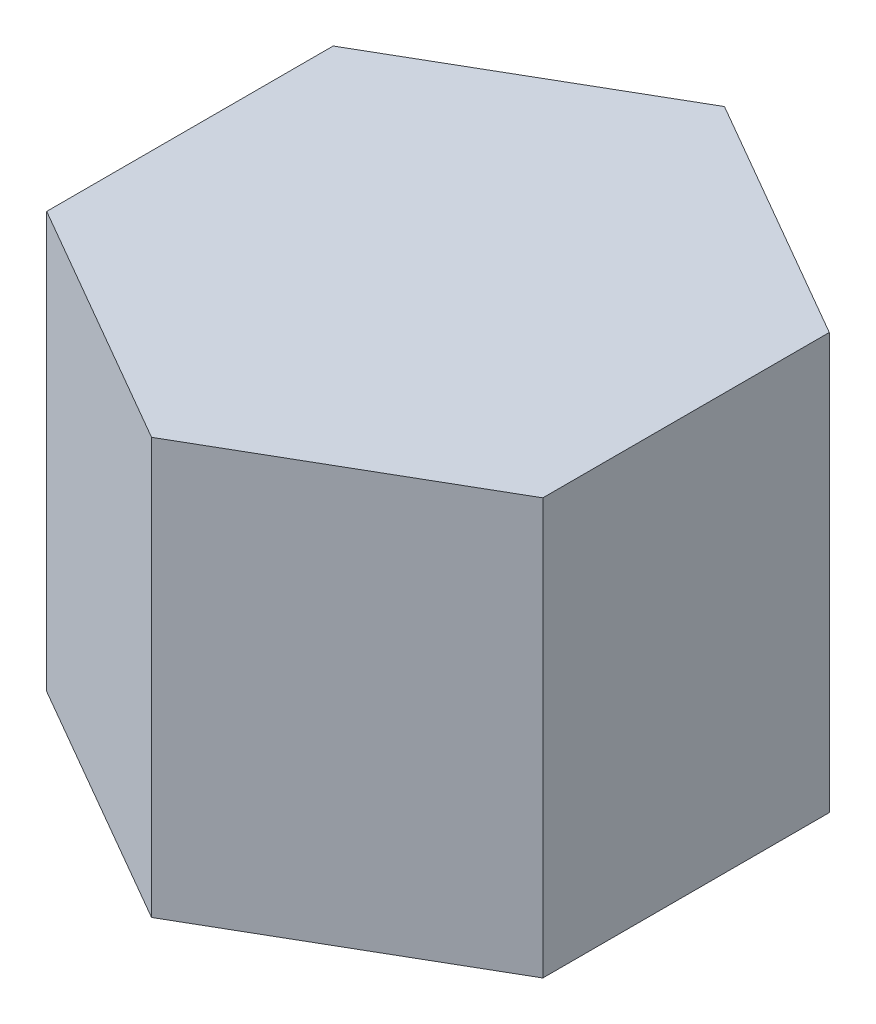
ISO-10303-21;
HEADER;
FILE_DESCRIPTION(('STEP AP214'),'2;1');
FILE_NAME('part.step','',(''),(''),'','','');
FILE_SCHEMA(('AUTOMOTIVE_DESIGN { 1 0 10303 214 1 1 1 1 }'));
ENDSEC;
DATA;
#1=APPLICATION_CONTEXT('core data for automotive mechanical design processes');
#2=APPLICATION_PROTOCOL_DEFINITION('international standard','automotive_design',2000,#1);
#3=PRODUCT_CONTEXT('',#1,'mechanical');
#4=PRODUCT('Part','Part','',(#3));
#5=PRODUCT_RELATED_PRODUCT_CATEGORY('part','',(#4));
#6=PRODUCT_DEFINITION_FORMATION('','',#4);
#7=PRODUCT_DEFINITION_CONTEXT('part definition',#1,'design');
#8=PRODUCT_DEFINITION('design','',#6,#7);
#9=PRODUCT_DEFINITION_SHAPE('','',#8);
#10=(LENGTH_UNIT() NAMED_UNIT(*) SI_UNIT(.MILLI.,.METRE.));
#11=(NAMED_UNIT(*) PLANE_ANGLE_UNIT() SI_UNIT($,.RADIAN.));
#12=(NAMED_UNIT(*) SI_UNIT($,.STERADIAN.) SOLID_ANGLE_UNIT());
#13=UNCERTAINTY_MEASURE_WITH_UNIT(LENGTH_MEASURE(1.E-05),#10,'distance_accuracy_value','');
#14=(GEOMETRIC_REPRESENTATION_CONTEXT(3) GLOBAL_UNCERTAINTY_ASSIGNED_CONTEXT((#13)) GLOBAL_UNIT_ASSIGNED_CONTEXT((#10,
#11,#12)) REPRESENTATION_CONTEXT('',''));
#15=CARTESIAN_POINT('',(0.,0.,0.));
#16=DIRECTION('',(0.,0.,1.));
#17=DIRECTION('',(1.,0.,0.));
#18=AXIS2_PLACEMENT_3D('',#15,#16,#17);
#19=CARTESIAN_POINT('',(210.642660308706,-148.537700895744,294.971072835632));
#20=DIRECTION('',(-0.499999999999909,0.,-0.866025403784491));
#21=DIRECTION('',(-0.866025403784491,0.,0.499999999999909));
#22=AXIS2_PLACEMENT_3D('',#19,#20,#21);
#23=PLANE('',#22);
#24=CARTESIAN_POINT('',(210.339551417381,-149.045793579175,295.146072835632));
#25=DIRECTION('',(0.866025403784491,0.,-0.499999999999909));
#26=VECTOR('',#25,1.);
#27=LINE('',#24,#26);
#28=CARTESIAN_POINT('',(210.339551417382,-149.045793579175,295.146072835632));
#29=VERTEX_POINT('',#28);
#30=CARTESIAN_POINT('',(210.642660308706,-149.045793579175,294.971072835632));
#31=VERTEX_POINT('',#30);
#32=EDGE_CURVE('E170',#29,#31,#27,.T.);
#33=ORIENTED_EDGE('',*,*,#32,.T.);
#34=CARTESIAN_POINT('',(210.642660308706,-148.537700895744,294.971072835632));
#35=DIRECTION('',(0.,-1.,0.));
#36=VECTOR('',#35,1.);
#37=LINE('',#34,#36);
#38=CARTESIAN_POINT('',(210.642660308706,-148.537700895744,294.971072835632));
#39=VERTEX_POINT('',#38);
#40=EDGE_CURVE('E35',#39,#31,#37,.T.);
#41=ORIENTED_EDGE('',*,*,#40,.F.);
#42=CARTESIAN_POINT('',(210.339551417381,-148.537700895744,295.146072835632));
#43=DIRECTION('',(0.866025403784491,0.,-0.499999999999909));
#44=VECTOR('',#43,1.);
#45=LINE('',#42,#44);
#46=CARTESIAN_POINT('',(210.339551417382,-148.537700895744,295.146072835632));
#47=VERTEX_POINT('',#46);
#48=EDGE_CURVE('E159',#47,#39,#45,.T.);
#49=ORIENTED_EDGE('',*,*,#48,.F.);
#50=CARTESIAN_POINT('',(210.339551417381,-148.537700895744,295.146072835632));
#51=DIRECTION('',(0.,-1.,0.));
#52=VECTOR('',#51,1.);
#53=LINE('',#50,#52);
#54=EDGE_CURVE('E10',#47,#29,#53,.T.);
#55=ORIENTED_EDGE('',*,*,#54,.T.);
#56=EDGE_LOOP('',(#33,#41,#49,#55));
#57=FACE_BOUND('',#56,.T.);
#58=ADVANCED_FACE('F16',(#57),#23,.F.);
#59=CARTESIAN_POINT('',(210.339551417382,-148.537700895744,295.146072835632));
#60=DIRECTION('',(0.500000000000096,0.,-0.866025403784383));
#61=DIRECTION('',(-0.866025403784383,0.,-0.500000000000096));
#62=AXIS2_PLACEMENT_3D('',#59,#60,#61);
#63=PLANE('',#62);
#64=CARTESIAN_POINT('',(210.036442526057,-149.045793579175,294.971072835632));
#65=DIRECTION('',(0.866025403784383,0.,0.500000000000096));
#66=VECTOR('',#65,1.);
#67=LINE('',#64,#66);
#68=CARTESIAN_POINT('',(210.036442526057,-149.045793579175,294.971072835632));
#69=VERTEX_POINT('',#68);
#70=EDGE_CURVE('E167',#69,#29,#67,.T.);
#71=ORIENTED_EDGE('',*,*,#70,.T.);
#72=ORIENTED_EDGE('',*,*,#54,.F.);
#73=CARTESIAN_POINT('',(210.036442526057,-148.537700895744,294.971072835632));
#74=DIRECTION('',(0.866025403784383,0.,0.500000000000096));
#75=VECTOR('',#74,1.);
#76=LINE('',#73,#75);
#77=CARTESIAN_POINT('',(210.036442526057,-148.537700895744,294.971072835632));
#78=VERTEX_POINT('',#77);
#79=EDGE_CURVE('E156',#78,#47,#76,.T.);
#80=ORIENTED_EDGE('',*,*,#79,.F.);
#81=CARTESIAN_POINT('',(210.036442526057,-148.537700895744,294.971072835632));
#82=DIRECTION('',(0.,-1.,0.));
#83=VECTOR('',#82,1.);
#84=LINE('',#81,#83);
#85=EDGE_CURVE('E27',#78,#69,#84,.T.);
#86=ORIENTED_EDGE('',*,*,#85,.T.);
#87=EDGE_LOOP('',(#71,#72,#80,#86));
#88=FACE_BOUND('',#87,.T.);
#89=ADVANCED_FACE('F189',(#88),#63,.F.);
#90=CARTESIAN_POINT('',(210.036442526057,-148.537700895744,290.831971220494));
#91=DIRECTION('',(1.,0.,0.));
#92=DIRECTION('',(0.,1.,0.));
#93=AXIS2_PLACEMENT_3D('',#90,#91,#92);
#94=PLANE('',#93);
#95=CARTESIAN_POINT('',(210.036442526057,-149.045793579175,294.621072835632));
#96=DIRECTION('',(0.,0.,1.));
#97=VECTOR('',#96,1.);
#98=LINE('',#95,#97);
#99=CARTESIAN_POINT('',(210.036442526057,-149.045793579175,294.621072835632));
#100=VERTEX_POINT('',#99);
#101=EDGE_CURVE('E163',#100,#69,#98,.T.);
#102=ORIENTED_EDGE('',*,*,#101,.T.);
#103=ORIENTED_EDGE('',*,*,#85,.F.);
#104=CARTESIAN_POINT('',(210.036442526057,-148.537700895744,294.621072835632));
#105=DIRECTION('',(0.,0.,1.));
#106=VECTOR('',#105,1.);
#107=LINE('',#104,#106);
#108=CARTESIAN_POINT('',(210.036442526057,-148.537700895744,294.621072835632));
#109=VERTEX_POINT('',#108);
#110=EDGE_CURVE('E106',#109,#78,#107,.T.);
#111=ORIENTED_EDGE('',*,*,#110,.F.);
#112=CARTESIAN_POINT('',(210.036442526057,-148.537700895744,294.621072835632));
#113=DIRECTION('',(0.,-1.,0.));
#114=VECTOR('',#113,1.);
#115=LINE('',#112,#114);
#116=EDGE_CURVE('E94',#109,#100,#115,.T.);
#117=ORIENTED_EDGE('',*,*,#116,.T.);
#118=EDGE_LOOP('',(#102,#103,#111,#117));
#119=FACE_BOUND('',#118,.T.);
#120=ADVANCED_FACE('F198',(#119),#94,.F.);
#121=CARTESIAN_POINT('',(210.036442526057,-148.537700895744,294.621072835632));
#122=DIRECTION('',(0.499999999999978,0.,0.866025403784452));
#123=DIRECTION('',(0.866025403784452,0.,-0.499999999999978));
#124=AXIS2_PLACEMENT_3D('',#121,#122,#123);
#125=PLANE('',#124);
#126=CARTESIAN_POINT('',(210.339551417382,-149.045793579175,294.446072835632));
#127=DIRECTION('',(-0.866025403784452,0.,0.499999999999978));
#128=VECTOR('',#127,1.);
#129=LINE('',#126,#128);
#130=CARTESIAN_POINT('',(210.339551417382,-149.045793579175,294.446072835632));
#131=VERTEX_POINT('',#130);
#132=EDGE_CURVE('E162',#131,#100,#129,.T.);
#133=ORIENTED_EDGE('',*,*,#132,.T.);
#134=ORIENTED_EDGE('',*,*,#116,.F.);
#135=CARTESIAN_POINT('',(210.339551417382,-148.537700895744,294.446072835632));
#136=DIRECTION('',(-0.866025403784452,0.,0.499999999999978));
#137=VECTOR('',#136,1.);
#138=LINE('',#135,#137);
#139=CARTESIAN_POINT('',(210.339551417382,-148.537700895744,294.446072835632));
#140=VERTEX_POINT('',#139);
#141=EDGE_CURVE('E98',#140,#109,#138,.T.);
#142=ORIENTED_EDGE('',*,*,#141,.F.);
#143=CARTESIAN_POINT('',(210.339551417382,-148.537700895744,294.446072835632));
#144=DIRECTION('',(0.,-1.,0.));
#145=VECTOR('',#144,1.);
#146=LINE('',#143,#145);
#147=EDGE_CURVE('E79',#140,#131,#146,.T.);
#148=ORIENTED_EDGE('',*,*,#147,.T.);
#149=EDGE_LOOP('',(#133,#134,#142,#148));
#150=FACE_BOUND('',#149,.T.);
#151=ADVANCED_FACE('F100',(#150),#125,.F.);
#152=CARTESIAN_POINT('',(210.339551417382,-148.537700895744,294.446072835632));
#153=DIRECTION('',(-0.500000000000062,0.,0.866025403784403));
#154=DIRECTION('',(0.866025403784403,0.,0.500000000000062));
#155=AXIS2_PLACEMENT_3D('',#152,#153,#154);
#156=PLANE('',#155);
#157=CARTESIAN_POINT('',(210.642660308706,-149.045793579175,294.621072835632));
#158=DIRECTION('',(-0.866025403784403,0.,-0.500000000000062));
#159=VECTOR('',#158,1.);
#160=LINE('',#157,#159);
#161=CARTESIAN_POINT('',(210.642660308706,-149.045793579175,294.621072835632));
#162=VERTEX_POINT('',#161);
#163=EDGE_CURVE('E88',#162,#131,#160,.T.);
#164=ORIENTED_EDGE('',*,*,#163,.T.);
#165=ORIENTED_EDGE('',*,*,#147,.F.);
#166=CARTESIAN_POINT('',(210.642660308706,-148.537700895744,294.621072835632));
#167=DIRECTION('',(-0.866025403784403,0.,-0.500000000000062));
#168=VECTOR('',#167,1.);
#169=LINE('',#166,#168);
#170=CARTESIAN_POINT('',(210.642660308706,-148.537700895744,294.621072835632));
#171=VERTEX_POINT('',#170);
#172=EDGE_CURVE('E84',#171,#140,#169,.T.);
#173=ORIENTED_EDGE('',*,*,#172,.F.);
#174=CARTESIAN_POINT('',(210.642660308706,-148.537700895744,294.621072835632));
#175=DIRECTION('',(0.,-1.,0.));
#176=VECTOR('',#175,1.);
#177=LINE('',#174,#176);
#178=EDGE_CURVE('E58',#171,#162,#177,.T.);
#179=ORIENTED_EDGE('',*,*,#178,.T.);
#180=EDGE_LOOP('',(#164,#165,#173,#179));
#181=FACE_BOUND('',#180,.T.);
#182=ADVANCED_FACE('F82',(#181),#156,.F.);
#183=CARTESIAN_POINT('',(210.642660308706,-148.537700895744,290.831971220494));
#184=DIRECTION('',(-1.,0.,0.));
#185=DIRECTION('',(0.,-1.,0.));
#186=AXIS2_PLACEMENT_3D('',#183,#184,#185);
#187=PLANE('',#186);
#188=CARTESIAN_POINT('',(210.642660308706,-149.045793579175,294.971072835632));
#189=DIRECTION('',(0.,0.,-1.));
#190=VECTOR('',#189,1.);
#191=LINE('',#188,#190);
#192=EDGE_CURVE('E160',#31,#162,#191,.T.);
#193=ORIENTED_EDGE('',*,*,#192,.T.);
#194=ORIENTED_EDGE('',*,*,#178,.F.);
#195=CARTESIAN_POINT('',(210.642660308706,-148.537700895744,294.971072835632));
#196=DIRECTION('',(0.,0.,-1.));
#197=VECTOR('',#196,1.);
#198=LINE('',#195,#197);
#199=EDGE_CURVE('E112',#39,#171,#198,.T.);
#200=ORIENTED_EDGE('',*,*,#199,.F.);
#201=ORIENTED_EDGE('',*,*,#40,.T.);
#202=EDGE_LOOP('',(#193,#194,#200,#201));
#203=FACE_BOUND('',#202,.T.);
#204=ADVANCED_FACE('F131',(#203),#187,.F.);
#205=CARTESIAN_POINT('',(206.339551417382,-148.537700895744,290.831971220494));
#206=DIRECTION('',(0.,-1.,0.));
#207=DIRECTION('',(1.,0.,0.));
#208=AXIS2_PLACEMENT_3D('',#205,#206,#207);
#209=PLANE('',#208);
#210=ORIENTED_EDGE('',*,*,#48,.T.);
#211=ORIENTED_EDGE('',*,*,#199,.T.);
#212=ORIENTED_EDGE('',*,*,#172,.T.);
#213=ORIENTED_EDGE('',*,*,#141,.T.);
#214=ORIENTED_EDGE('',*,*,#110,.T.);
#215=ORIENTED_EDGE('',*,*,#79,.T.);
#216=EDGE_LOOP('',(#210,#211,#212,#213,#214,#215));
#217=FACE_BOUND('',#216,.T.);
#218=ADVANCED_FACE('F111',(#217),#209,.F.);
#219=CARTESIAN_POINT('',(206.339551417382,-149.045793579175,290.831971220494));
#220=DIRECTION('',(0.,-1.,0.));
#221=DIRECTION('',(1.,0.,0.));
#222=AXIS2_PLACEMENT_3D('',#219,#220,#221);
#223=PLANE('',#222);
#224=ORIENTED_EDGE('',*,*,#32,.F.);
#225=ORIENTED_EDGE('',*,*,#70,.F.);
#226=ORIENTED_EDGE('',*,*,#101,.F.);
#227=ORIENTED_EDGE('',*,*,#132,.F.);
#228=ORIENTED_EDGE('',*,*,#163,.F.);
#229=ORIENTED_EDGE('',*,*,#192,.F.);
#230=EDGE_LOOP('',(#224,#225,#226,#227,#228,#229));
#231=FACE_BOUND('',#230,.T.);
#232=ADVANCED_FACE('F130',(#231),#223,.T.);
#233=CLOSED_SHELL('',(#58,#89,#120,#151,#182,#204,#218,#232));
#234=MANIFOLD_SOLID_BREP('B1',#233);
#235=ADVANCED_BREP_SHAPE_REPRESENTATION('',(#18,#234),#14);
#236=SHAPE_DEFINITION_REPRESENTATION(#9,#235);
ENDSEC;
END-ISO-10303-21;
